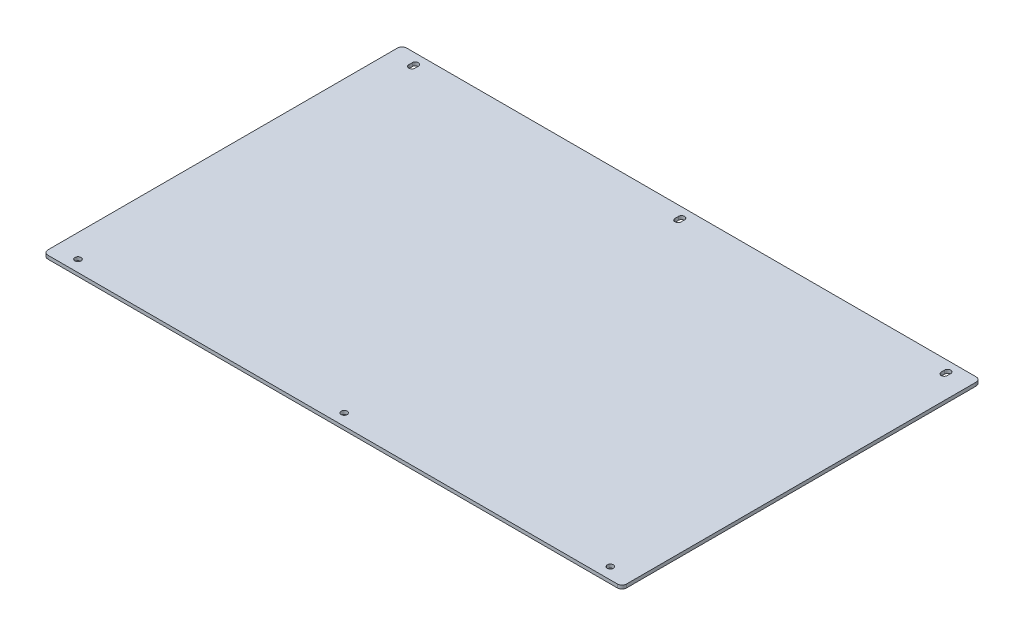
ISO-10303-21;
HEADER;
FILE_DESCRIPTION(('STEP AP214'),'2;1');
FILE_NAME('part.step','',(''),(''),'','','');
FILE_SCHEMA(('AUTOMOTIVE_DESIGN { 1 0 10303 214 1 1 1 1 }'));
ENDSEC;
DATA;
#1=APPLICATION_CONTEXT('core data for automotive mechanical design processes');
#2=APPLICATION_PROTOCOL_DEFINITION('international standard','automotive_design',2000,#1);
#3=PRODUCT_CONTEXT('',#1,'mechanical');
#4=PRODUCT('Part','Part','',(#3));
#5=PRODUCT_RELATED_PRODUCT_CATEGORY('part','',(#4));
#6=PRODUCT_DEFINITION_FORMATION('','',#4);
#7=PRODUCT_DEFINITION_CONTEXT('part definition',#1,'design');
#8=PRODUCT_DEFINITION('design','',#6,#7);
#9=PRODUCT_DEFINITION_SHAPE('','',#8);
#10=(LENGTH_UNIT() NAMED_UNIT(*) SI_UNIT(.MILLI.,.METRE.));
#11=(NAMED_UNIT(*) PLANE_ANGLE_UNIT() SI_UNIT($,.RADIAN.));
#12=(NAMED_UNIT(*) SI_UNIT($,.STERADIAN.) SOLID_ANGLE_UNIT());
#13=UNCERTAINTY_MEASURE_WITH_UNIT(LENGTH_MEASURE(1.E-05),#10,'distance_accuracy_value','');
#14=(GEOMETRIC_REPRESENTATION_CONTEXT(3) GLOBAL_UNCERTAINTY_ASSIGNED_CONTEXT((#13)) GLOBAL_UNIT_ASSIGNED_CONTEXT((#10,
#11,#12)) REPRESENTATION_CONTEXT('',''));
#15=CARTESIAN_POINT('',(0.,0.,0.));
#16=DIRECTION('',(0.,0.,1.));
#17=DIRECTION('',(1.,0.,0.));
#18=AXIS2_PLACEMENT_3D('',#15,#16,#17);
#19=CARTESIAN_POINT('',(250.,3.,155.));
#20=DIRECTION('',(-1.,0.,0.));
#21=DIRECTION('',(0.,0.,1.));
#22=AXIS2_PLACEMENT_3D('',#19,#20,#21);
#23=PLANE('',#22);
#24=DIRECTION('',(0.,0.,-1.));
#25=VECTOR('',#24,1.);
#26=CARTESIAN_POINT('',(250.,0.,155.));
#27=LINE('',#26,#25);
#28=CARTESIAN_POINT('',(250.,0.,151.));
#29=VERTEX_POINT('',#28);
#30=CARTESIAN_POINT('',(250.,0.,-151.));
#31=VERTEX_POINT('',#30);
#32=EDGE_CURVE('E292',#29,#31,#27,.T.);
#33=ORIENTED_EDGE('',*,*,#32,.T.);
#34=DIRECTION('',(0.,-1.,0.));
#35=VECTOR('',#34,1.);
#36=CARTESIAN_POINT('',(250.,3.,-151.));
#37=LINE('',#36,#35);
#38=CARTESIAN_POINT('',(250.,3.,-151.));
#39=VERTEX_POINT('',#38);
#40=EDGE_CURVE('E11',#31,#39,#37,.F.);
#41=ORIENTED_EDGE('',*,*,#40,.T.);
#42=DIRECTION('',(0.,0.,-1.));
#43=VECTOR('',#42,1.);
#44=CARTESIAN_POINT('',(250.,3.,155.));
#45=LINE('',#44,#43);
#46=CARTESIAN_POINT('',(250.,3.,151.));
#47=VERTEX_POINT('',#46);
#48=EDGE_CURVE('E293',#47,#39,#45,.T.);
#49=ORIENTED_EDGE('',*,*,#48,.F.);
#50=DIRECTION('',(0.,-1.,0.));
#51=VECTOR('',#50,1.);
#52=CARTESIAN_POINT('',(250.,3.,151.));
#53=LINE('',#52,#51);
#54=EDGE_CURVE('E41',#47,#29,#53,.T.);
#55=ORIENTED_EDGE('',*,*,#54,.T.);
#56=EDGE_LOOP('',(#33,#41,#49,#55));
#57=FACE_BOUND('',#56,.T.);
#58=ADVANCED_FACE('F33',(#57),#23,.F.);
#59=CARTESIAN_POINT('',(-250.,3.,-155.));
#60=DIRECTION('',(0.,0.,1.));
#61=DIRECTION('',(1.,0.,0.));
#62=AXIS2_PLACEMENT_3D('',#59,#60,#61);
#63=PLANE('',#62);
#64=DIRECTION('',(-1.,0.,0.));
#65=VECTOR('',#64,1.);
#66=CARTESIAN_POINT('',(-250.,0.,-155.));
#67=LINE('',#66,#65);
#68=CARTESIAN_POINT('',(246.,0.,-155.));
#69=VERTEX_POINT('',#68);
#70=CARTESIAN_POINT('',(-246.,0.,-155.));
#71=VERTEX_POINT('',#70);
#72=EDGE_CURVE('E309',#69,#71,#67,.T.);
#73=ORIENTED_EDGE('',*,*,#72,.T.);
#74=DIRECTION('',(0.,-1.,0.));
#75=VECTOR('',#74,1.);
#76=CARTESIAN_POINT('',(-246.,3.,-155.));
#77=LINE('',#76,#75);
#78=CARTESIAN_POINT('',(-246.,3.,-155.));
#79=VERTEX_POINT('',#78);
#80=EDGE_CURVE('E345',#71,#79,#77,.F.);
#81=ORIENTED_EDGE('',*,*,#80,.T.);
#82=DIRECTION('',(-1.,0.,0.));
#83=VECTOR('',#82,1.);
#84=CARTESIAN_POINT('',(-250.,3.,-155.));
#85=LINE('',#84,#83);
#86=CARTESIAN_POINT('',(246.,3.,-155.));
#87=VERTEX_POINT('',#86);
#88=EDGE_CURVE('E296',#87,#79,#85,.T.);
#89=ORIENTED_EDGE('',*,*,#88,.F.);
#90=DIRECTION('',(0.,-1.,0.));
#91=VECTOR('',#90,1.);
#92=CARTESIAN_POINT('',(246.,3.,-155.));
#93=LINE('',#92,#91);
#94=EDGE_CURVE('E342',#87,#69,#93,.T.);
#95=ORIENTED_EDGE('',*,*,#94,.T.);
#96=EDGE_LOOP('',(#73,#81,#89,#95));
#97=FACE_BOUND('',#96,.T.);
#98=ADVANCED_FACE('F363',(#97),#63,.F.);
#99=CARTESIAN_POINT('',(-250.,3.,155.));
#100=DIRECTION('',(1.,0.,0.));
#101=DIRECTION('',(0.,0.,-1.));
#102=AXIS2_PLACEMENT_3D('',#99,#100,#101);
#103=PLANE('',#102);
#104=DIRECTION('',(0.,0.,1.));
#105=VECTOR('',#104,1.);
#106=CARTESIAN_POINT('',(-250.,0.,155.));
#107=LINE('',#106,#105);
#108=CARTESIAN_POINT('',(-250.,0.,-151.));
#109=VERTEX_POINT('',#108);
#110=CARTESIAN_POINT('',(-250.,0.,151.));
#111=VERTEX_POINT('',#110);
#112=EDGE_CURVE('E312',#109,#111,#107,.T.);
#113=ORIENTED_EDGE('',*,*,#112,.T.);
#114=DIRECTION('',(0.,-1.,0.));
#115=VECTOR('',#114,1.);
#116=CARTESIAN_POINT('',(-250.,3.,151.));
#117=LINE('',#116,#115);
#118=CARTESIAN_POINT('',(-250.,3.,151.));
#119=VERTEX_POINT('',#118);
#120=EDGE_CURVE('E332',#111,#119,#117,.F.);
#121=ORIENTED_EDGE('',*,*,#120,.T.);
#122=DIRECTION('',(0.,0.,1.));
#123=VECTOR('',#122,1.);
#124=CARTESIAN_POINT('',(-250.,3.,155.));
#125=LINE('',#124,#123);
#126=CARTESIAN_POINT('',(-250.,3.,-151.));
#127=VERTEX_POINT('',#126);
#128=EDGE_CURVE('E300',#127,#119,#125,.T.);
#129=ORIENTED_EDGE('',*,*,#128,.F.);
#130=DIRECTION('',(0.,-1.,0.));
#131=VECTOR('',#130,1.);
#132=CARTESIAN_POINT('',(-250.,3.,-151.));
#133=LINE('',#132,#131);
#134=EDGE_CURVE('E329',#127,#109,#133,.T.);
#135=ORIENTED_EDGE('',*,*,#134,.T.);
#136=EDGE_LOOP('',(#113,#121,#129,#135));
#137=FACE_BOUND('',#136,.T.);
#138=ADVANCED_FACE('F374',(#137),#103,.F.);
#139=CARTESIAN_POINT('',(-250.,3.,155.));
#140=DIRECTION('',(0.,0.,-1.));
#141=DIRECTION('',(-1.,0.,0.));
#142=AXIS2_PLACEMENT_3D('',#139,#140,#141);
#143=PLANE('',#142);
#144=DIRECTION('',(1.,0.,0.));
#145=VECTOR('',#144,1.);
#146=CARTESIAN_POINT('',(-250.,3.,155.));
#147=LINE('',#146,#145);
#148=CARTESIAN_POINT('',(-246.,3.,155.));
#149=VERTEX_POINT('',#148);
#150=CARTESIAN_POINT('',(246.,3.,155.));
#151=VERTEX_POINT('',#150);
#152=EDGE_CURVE('E303',#149,#151,#147,.T.);
#153=ORIENTED_EDGE('',*,*,#152,.F.);
#154=DIRECTION('',(0.,-1.,0.));
#155=VECTOR('',#154,1.);
#156=CARTESIAN_POINT('',(-246.,3.,155.));
#157=LINE('',#156,#155);
#158=CARTESIAN_POINT('',(-246.,0.,155.));
#159=VERTEX_POINT('',#158);
#160=EDGE_CURVE('E318',#149,#159,#157,.T.);
#161=ORIENTED_EDGE('',*,*,#160,.T.);
#162=DIRECTION('',(1.,0.,0.));
#163=VECTOR('',#162,1.);
#164=CARTESIAN_POINT('',(-250.,0.,155.));
#165=LINE('',#164,#163);
#166=CARTESIAN_POINT('',(246.,0.,155.));
#167=VERTEX_POINT('',#166);
#168=EDGE_CURVE('E297',#159,#167,#165,.T.);
#169=ORIENTED_EDGE('',*,*,#168,.T.);
#170=DIRECTION('',(0.,-1.,0.));
#171=VECTOR('',#170,1.);
#172=CARTESIAN_POINT('',(246.,3.,155.));
#173=LINE('',#172,#171);
#174=EDGE_CURVE('E306',#167,#151,#173,.F.);
#175=ORIENTED_EDGE('',*,*,#174,.T.);
#176=EDGE_LOOP('',(#153,#161,#169,#175));
#177=FACE_BOUND('',#176,.T.);
#178=ADVANCED_FACE('F382',(#177),#143,.F.);
#179=CARTESIAN_POINT('',(0.,3.,0.));
#180=DIRECTION('',(0.,-1.,0.));
#181=DIRECTION('',(0.,0.,-1.));
#182=AXIS2_PLACEMENT_3D('',#179,#180,#181);
#183=PLANE('',#182);
#184=DIRECTION('',(0.,0.,-1.));
#185=VECTOR('',#184,1.);
#186=CARTESIAN_POINT('',(232.65,3.,-143.5));
#187=LINE('',#186,#185);
#188=CARTESIAN_POINT('',(232.65,3.,-143.5));
#189=VERTEX_POINT('',#188);
#190=CARTESIAN_POINT('',(232.65,3.,-146.5));
#191=VERTEX_POINT('',#190);
#192=EDGE_CURVE('E260',#189,#191,#187,.T.);
#193=ORIENTED_EDGE('',*,*,#192,.F.);
#194=CARTESIAN_POINT('',(230.,3.,-143.5));
#195=DIRECTION('',(0.,1.,0.));
#196=DIRECTION('',(0.,0.,1.));
#197=AXIS2_PLACEMENT_3D('',#194,#195,#196);
#198=CIRCLE('',#197,2.64999999999999);
#199=CARTESIAN_POINT('',(227.35,3.,-143.5));
#200=VERTEX_POINT('',#199);
#201=EDGE_CURVE('E257',#200,#189,#198,.T.);
#202=ORIENTED_EDGE('',*,*,#201,.F.);
#203=DIRECTION('',(0.,0.,1.));
#204=VECTOR('',#203,1.);
#205=CARTESIAN_POINT('',(227.35,3.,-143.5));
#206=LINE('',#205,#204);
#207=CARTESIAN_POINT('',(227.35,3.,-146.5));
#208=VERTEX_POINT('',#207);
#209=EDGE_CURVE('E247',#208,#200,#206,.T.);
#210=ORIENTED_EDGE('',*,*,#209,.F.);
#211=CARTESIAN_POINT('',(230.,3.,-146.5));
#212=DIRECTION('',(0.,1.,0.));
#213=DIRECTION('',(0.,0.,1.));
#214=AXIS2_PLACEMENT_3D('',#211,#212,#213);
#215=CIRCLE('',#214,2.64999999999999);
#216=EDGE_CURVE('E262',#191,#208,#215,.T.);
#217=ORIENTED_EDGE('',*,*,#216,.F.);
#218=EDGE_LOOP('',(#193,#202,#210,#217));
#219=FACE_BOUND('',#218,.T.);
#220=CARTESIAN_POINT('',(-230.,3.,145.));
#221=DIRECTION('',(0.,1.,0.));
#222=DIRECTION('',(0.,0.,1.));
#223=AXIS2_PLACEMENT_3D('',#220,#221,#222);
#224=CIRCLE('',#223,2.64999999999999);
#225=CARTESIAN_POINT('',(-230.,3.,147.65));
#226=VERTEX_POINT('',#225);
#227=EDGE_CURVE('E208',#226,#226,#224,.T.);
#228=ORIENTED_EDGE('',*,*,#227,.F.);
#229=EDGE_LOOP('',(#228));
#230=FACE_BOUND('',#229,.T.);
#231=DIRECTION('',(0.,0.,-1.));
#232=VECTOR('',#231,1.);
#233=CARTESIAN_POINT('',(-227.35,3.,-143.5));
#234=LINE('',#233,#232);
#235=CARTESIAN_POINT('',(-227.35,3.,-143.5));
#236=VERTEX_POINT('',#235);
#237=CARTESIAN_POINT('',(-227.35,3.,-146.5));
#238=VERTEX_POINT('',#237);
#239=EDGE_CURVE('E48',#236,#238,#234,.T.);
#240=ORIENTED_EDGE('',*,*,#239,.F.);
#241=CARTESIAN_POINT('',(-230.,3.,-143.5));
#242=DIRECTION('',(0.,1.,0.));
#243=DIRECTION('',(0.,0.,1.));
#244=AXIS2_PLACEMENT_3D('',#241,#242,#243);
#245=CIRCLE('',#244,2.64999999999999);
#246=CARTESIAN_POINT('',(-232.65,3.,-143.5));
#247=VERTEX_POINT('',#246);
#248=EDGE_CURVE('E189',#247,#236,#245,.T.);
#249=ORIENTED_EDGE('',*,*,#248,.F.);
#250=DIRECTION('',(0.,0.,1.));
#251=VECTOR('',#250,1.);
#252=CARTESIAN_POINT('',(-232.65,3.,-143.5));
#253=LINE('',#252,#251);
#254=CARTESIAN_POINT('',(-232.65,3.,-146.5));
#255=VERTEX_POINT('',#254);
#256=EDGE_CURVE('E194',#255,#247,#253,.T.);
#257=ORIENTED_EDGE('',*,*,#256,.F.);
#258=CARTESIAN_POINT('',(-230.,3.,-146.5));
#259=DIRECTION('',(0.,1.,0.));
#260=DIRECTION('',(0.,0.,1.));
#261=AXIS2_PLACEMENT_3D('',#258,#259,#260);
#262=CIRCLE('',#261,2.64999999999999);
#263=EDGE_CURVE('E196',#238,#255,#262,.T.);
#264=ORIENTED_EDGE('',*,*,#263,.F.);
#265=EDGE_LOOP('',(#240,#249,#257,#264));
#266=FACE_BOUND('',#265,.T.);
#267=CARTESIAN_POINT('',(230.,3.,145.));
#268=DIRECTION('',(0.,1.,0.));
#269=DIRECTION('',(0.,0.,1.));
#270=AXIS2_PLACEMENT_3D('',#267,#268,#269);
#271=CIRCLE('',#270,2.64999999999999);
#272=CARTESIAN_POINT('',(230.,3.,147.65));
#273=VERTEX_POINT('',#272);
#274=EDGE_CURVE('E280',#273,#273,#271,.T.);
#275=ORIENTED_EDGE('',*,*,#274,.F.);
#276=EDGE_LOOP('',(#275));
#277=FACE_BOUND('',#276,.T.);
#278=DIRECTION('',(0.,0.,-1.));
#279=VECTOR('',#278,1.);
#280=CARTESIAN_POINT('',(2.65000000000007,3.,-143.5));
#281=LINE('',#280,#279);
#282=CARTESIAN_POINT('',(2.65000000000007,3.,-143.5));
#283=VERTEX_POINT('',#282);
#284=CARTESIAN_POINT('',(2.65000000000007,3.,-146.5));
#285=VERTEX_POINT('',#284);
#286=EDGE_CURVE('E56',#283,#285,#281,.T.);
#287=ORIENTED_EDGE('',*,*,#286,.F.);
#288=CARTESIAN_POINT('',(0.,3.,-143.5));
#289=DIRECTION('',(0.,1.,0.));
#290=DIRECTION('',(0.,0.,1.));
#291=AXIS2_PLACEMENT_3D('',#288,#289,#290);
#292=CIRCLE('',#291,2.64999999999999);
#293=CARTESIAN_POINT('',(-2.6499999999999,3.,-143.5));
#294=VERTEX_POINT('',#293);
#295=EDGE_CURVE('E226',#294,#283,#292,.T.);
#296=ORIENTED_EDGE('',*,*,#295,.F.);
#297=DIRECTION('',(0.,0.,1.));
#298=VECTOR('',#297,1.);
#299=CARTESIAN_POINT('',(-2.6499999999999,3.,-143.5));
#300=LINE('',#299,#298);
#301=CARTESIAN_POINT('',(-2.6499999999999,3.,-146.5));
#302=VERTEX_POINT('',#301);
#303=EDGE_CURVE('E216',#302,#294,#300,.T.);
#304=ORIENTED_EDGE('',*,*,#303,.F.);
#305=CARTESIAN_POINT('',(0.,3.,-146.5));
#306=DIRECTION('',(0.,1.,0.));
#307=DIRECTION('',(0.,0.,1.));
#308=AXIS2_PLACEMENT_3D('',#305,#306,#307);
#309=CIRCLE('',#308,2.64999999999999);
#310=EDGE_CURVE('E230',#285,#302,#309,.T.);
#311=ORIENTED_EDGE('',*,*,#310,.F.);
#312=EDGE_LOOP('',(#287,#296,#304,#311));
#313=FACE_BOUND('',#312,.T.);
#314=CARTESIAN_POINT('',(0.,3.,145.));
#315=DIRECTION('',(0.,1.,0.));
#316=DIRECTION('',(0.,0.,1.));
#317=AXIS2_PLACEMENT_3D('',#314,#315,#316);
#318=CIRCLE('',#317,2.65);
#319=CARTESIAN_POINT('',(0.,3.,147.65));
#320=VERTEX_POINT('',#319);
#321=EDGE_CURVE('E286',#320,#320,#318,.T.);
#322=ORIENTED_EDGE('',*,*,#321,.F.);
#323=EDGE_LOOP('',(#322));
#324=FACE_BOUND('',#323,.T.);
#325=ORIENTED_EDGE('',*,*,#128,.T.);
#326=CARTESIAN_POINT('',(-246.,3.,151.));
#327=DIRECTION('',(0.,-1.,0.));
#328=DIRECTION('',(0.,0.,-1.));
#329=AXIS2_PLACEMENT_3D('',#326,#327,#328);
#330=CIRCLE('',#329,4.);
#331=EDGE_CURVE('E340',#119,#149,#330,.F.);
#332=ORIENTED_EDGE('',*,*,#331,.T.);
#333=ORIENTED_EDGE('',*,*,#152,.T.);
#334=CARTESIAN_POINT('',(246.,3.,151.));
#335=DIRECTION('',(0.,-1.,0.));
#336=DIRECTION('',(0.,0.,-1.));
#337=AXIS2_PLACEMENT_3D('',#334,#335,#336);
#338=CIRCLE('',#337,4.);
#339=EDGE_CURVE('E334',#151,#47,#338,.F.);
#340=ORIENTED_EDGE('',*,*,#339,.T.);
#341=ORIENTED_EDGE('',*,*,#48,.T.);
#342=CARTESIAN_POINT('',(246.,3.,-151.));
#343=DIRECTION('',(0.,-1.,0.));
#344=DIRECTION('',(0.,0.,-1.));
#345=AXIS2_PLACEMENT_3D('',#342,#343,#344);
#346=CIRCLE('',#345,4.);
#347=EDGE_CURVE('E336',#39,#87,#346,.F.);
#348=ORIENTED_EDGE('',*,*,#347,.T.);
#349=ORIENTED_EDGE('',*,*,#88,.T.);
#350=CARTESIAN_POINT('',(-246.,3.,-151.));
#351=DIRECTION('',(0.,-1.,0.));
#352=DIRECTION('',(0.,0.,-1.));
#353=AXIS2_PLACEMENT_3D('',#350,#351,#352);
#354=CIRCLE('',#353,4.);
#355=EDGE_CURVE('E338',#79,#127,#354,.F.);
#356=ORIENTED_EDGE('',*,*,#355,.T.);
#357=EDGE_LOOP('',(#325,#332,#333,#340,#341,#348,#349,#356));
#358=FACE_BOUND('',#357,.T.);
#359=ADVANCED_FACE('F367',(#219,#230,#266,#277,#313,#324,#358),#183,.F.);
#360=CARTESIAN_POINT('',(0.,0.,0.));
#361=DIRECTION('',(0.,-1.,0.));
#362=DIRECTION('',(0.,0.,-1.));
#363=AXIS2_PLACEMENT_3D('',#360,#361,#362);
#364=PLANE('',#363);
#365=CARTESIAN_POINT('',(-230.,0.,-143.5));
#366=DIRECTION('',(0.,1.,0.));
#367=DIRECTION('',(0.,0.,1.));
#368=AXIS2_PLACEMENT_3D('',#365,#366,#367);
#369=CIRCLE('',#368,2.64999999999999);
#370=CARTESIAN_POINT('',(-232.65,0.,-143.5));
#371=VERTEX_POINT('',#370);
#372=CARTESIAN_POINT('',(-227.35,0.,-143.5));
#373=VERTEX_POINT('',#372);
#374=EDGE_CURVE('E182',#371,#373,#369,.T.);
#375=ORIENTED_EDGE('',*,*,#374,.T.);
#376=DIRECTION('',(0.,0.,-1.));
#377=VECTOR('',#376,1.);
#378=CARTESIAN_POINT('',(-227.35,0.,-143.5));
#379=LINE('',#378,#377);
#380=CARTESIAN_POINT('',(-227.35,0.,-146.5));
#381=VERTEX_POINT('',#380);
#382=EDGE_CURVE('E171',#373,#381,#379,.T.);
#383=ORIENTED_EDGE('',*,*,#382,.T.);
#384=CARTESIAN_POINT('',(-230.,0.,-146.5));
#385=DIRECTION('',(0.,1.,0.));
#386=DIRECTION('',(0.,0.,1.));
#387=AXIS2_PLACEMENT_3D('',#384,#385,#386);
#388=CIRCLE('',#387,2.64999999999999);
#389=CARTESIAN_POINT('',(-232.65,0.,-146.5));
#390=VERTEX_POINT('',#389);
#391=EDGE_CURVE('E181',#381,#390,#388,.T.);
#392=ORIENTED_EDGE('',*,*,#391,.T.);
#393=DIRECTION('',(0.,0.,1.));
#394=VECTOR('',#393,1.);
#395=CARTESIAN_POINT('',(-232.65,0.,-143.5));
#396=LINE('',#395,#394);
#397=EDGE_CURVE('E190',#390,#371,#396,.T.);
#398=ORIENTED_EDGE('',*,*,#397,.T.);
#399=EDGE_LOOP('',(#375,#383,#392,#398));
#400=FACE_BOUND('',#399,.T.);
#401=CARTESIAN_POINT('',(0.,0.,-143.5));
#402=DIRECTION('',(0.,1.,0.));
#403=DIRECTION('',(0.,0.,1.));
#404=AXIS2_PLACEMENT_3D('',#401,#402,#403);
#405=CIRCLE('',#404,2.64999999999999);
#406=CARTESIAN_POINT('',(-2.6499999999999,0.,-143.5));
#407=VERTEX_POINT('',#406);
#408=CARTESIAN_POINT('',(2.65000000000007,0.,-143.5));
#409=VERTEX_POINT('',#408);
#410=EDGE_CURVE('E212',#407,#409,#405,.T.);
#411=ORIENTED_EDGE('',*,*,#410,.T.);
#412=DIRECTION('',(0.,0.,-1.));
#413=VECTOR('',#412,1.);
#414=CARTESIAN_POINT('',(2.65000000000007,0.,-143.5));
#415=LINE('',#414,#413);
#416=CARTESIAN_POINT('',(2.65000000000007,0.,-146.5));
#417=VERTEX_POINT('',#416);
#418=EDGE_CURVE('E215',#409,#417,#415,.T.);
#419=ORIENTED_EDGE('',*,*,#418,.T.);
#420=CARTESIAN_POINT('',(0.,0.,-146.5));
#421=DIRECTION('',(0.,1.,0.));
#422=DIRECTION('',(0.,0.,1.));
#423=AXIS2_PLACEMENT_3D('',#420,#421,#422);
#424=CIRCLE('',#423,2.64999999999999);
#425=CARTESIAN_POINT('',(-2.6499999999999,0.,-146.5));
#426=VERTEX_POINT('',#425);
#427=EDGE_CURVE('E219',#417,#426,#424,.T.);
#428=ORIENTED_EDGE('',*,*,#427,.T.);
#429=DIRECTION('',(0.,0.,1.));
#430=VECTOR('',#429,1.);
#431=CARTESIAN_POINT('',(-2.6499999999999,0.,-143.5));
#432=LINE('',#431,#430);
#433=EDGE_CURVE('E222',#426,#407,#432,.T.);
#434=ORIENTED_EDGE('',*,*,#433,.T.);
#435=EDGE_LOOP('',(#411,#419,#428,#434));
#436=FACE_BOUND('',#435,.T.);
#437=CARTESIAN_POINT('',(230.,0.,-143.5));
#438=DIRECTION('',(0.,1.,0.));
#439=DIRECTION('',(0.,0.,1.));
#440=AXIS2_PLACEMENT_3D('',#437,#438,#439);
#441=CIRCLE('',#440,2.64999999999999);
#442=CARTESIAN_POINT('',(227.35,0.,-143.5));
#443=VERTEX_POINT('',#442);
#444=CARTESIAN_POINT('',(232.65,0.,-143.5));
#445=VERTEX_POINT('',#444);
#446=EDGE_CURVE('E243',#443,#445,#441,.T.);
#447=ORIENTED_EDGE('',*,*,#446,.T.);
#448=DIRECTION('',(0.,0.,-1.));
#449=VECTOR('',#448,1.);
#450=CARTESIAN_POINT('',(232.65,0.,-143.5));
#451=LINE('',#450,#449);
#452=CARTESIAN_POINT('',(232.65,0.,-146.5));
#453=VERTEX_POINT('',#452);
#454=EDGE_CURVE('E246',#445,#453,#451,.T.);
#455=ORIENTED_EDGE('',*,*,#454,.T.);
#456=CARTESIAN_POINT('',(230.,0.,-146.5));
#457=DIRECTION('',(0.,1.,0.));
#458=DIRECTION('',(0.,0.,1.));
#459=AXIS2_PLACEMENT_3D('',#456,#457,#458);
#460=CIRCLE('',#459,2.64999999999999);
#461=CARTESIAN_POINT('',(227.35,0.,-146.5));
#462=VERTEX_POINT('',#461);
#463=EDGE_CURVE('E250',#453,#462,#460,.T.);
#464=ORIENTED_EDGE('',*,*,#463,.T.);
#465=DIRECTION('',(0.,0.,1.));
#466=VECTOR('',#465,1.);
#467=CARTESIAN_POINT('',(227.35,0.,-143.5));
#468=LINE('',#467,#466);
#469=EDGE_CURVE('E253',#462,#443,#468,.T.);
#470=ORIENTED_EDGE('',*,*,#469,.T.);
#471=EDGE_LOOP('',(#447,#455,#464,#470));
#472=FACE_BOUND('',#471,.T.);
#473=CARTESIAN_POINT('',(-230.,0.,145.));
#474=DIRECTION('',(0.,1.,0.));
#475=DIRECTION('',(0.,0.,1.));
#476=AXIS2_PLACEMENT_3D('',#473,#474,#475);
#477=CIRCLE('',#476,2.64999999999999);
#478=CARTESIAN_POINT('',(-230.,0.,147.65));
#479=VERTEX_POINT('',#478);
#480=EDGE_CURVE('E277',#479,#479,#477,.T.);
#481=ORIENTED_EDGE('',*,*,#480,.T.);
#482=EDGE_LOOP('',(#481));
#483=FACE_BOUND('',#482,.T.);
#484=CARTESIAN_POINT('',(230.,0.,145.));
#485=DIRECTION('',(0.,1.,0.));
#486=DIRECTION('',(0.,0.,1.));
#487=AXIS2_PLACEMENT_3D('',#484,#485,#486);
#488=CIRCLE('',#487,2.64999999999999);
#489=CARTESIAN_POINT('',(230.,0.,147.65));
#490=VERTEX_POINT('',#489);
#491=EDGE_CURVE('E283',#490,#490,#488,.T.);
#492=ORIENTED_EDGE('',*,*,#491,.T.);
#493=EDGE_LOOP('',(#492));
#494=FACE_BOUND('',#493,.T.);
#495=CARTESIAN_POINT('',(0.,0.,145.));
#496=DIRECTION('',(0.,1.,0.));
#497=DIRECTION('',(0.,0.,1.));
#498=AXIS2_PLACEMENT_3D('',#495,#496,#497);
#499=CIRCLE('',#498,2.65);
#500=CARTESIAN_POINT('',(0.,0.,147.65));
#501=VERTEX_POINT('',#500);
#502=EDGE_CURVE('E289',#501,#501,#499,.T.);
#503=ORIENTED_EDGE('',*,*,#502,.T.);
#504=EDGE_LOOP('',(#503));
#505=FACE_BOUND('',#504,.T.);
#506=ORIENTED_EDGE('',*,*,#168,.F.);
#507=CARTESIAN_POINT('',(-246.,0.,151.));
#508=DIRECTION('',(0.,-1.,0.));
#509=DIRECTION('',(0.,0.,-1.));
#510=AXIS2_PLACEMENT_3D('',#507,#508,#509);
#511=CIRCLE('',#510,4.);
#512=EDGE_CURVE('E327',#159,#111,#511,.T.);
#513=ORIENTED_EDGE('',*,*,#512,.T.);
#514=ORIENTED_EDGE('',*,*,#112,.F.);
#515=CARTESIAN_POINT('',(-246.,0.,-151.));
#516=DIRECTION('',(0.,-1.,0.));
#517=DIRECTION('',(0.,0.,-1.));
#518=AXIS2_PLACEMENT_3D('',#515,#516,#517);
#519=CIRCLE('',#518,4.);
#520=EDGE_CURVE('E325',#109,#71,#519,.T.);
#521=ORIENTED_EDGE('',*,*,#520,.T.);
#522=ORIENTED_EDGE('',*,*,#72,.F.);
#523=CARTESIAN_POINT('',(246.,0.,-151.));
#524=DIRECTION('',(0.,-1.,0.));
#525=DIRECTION('',(0.,0.,-1.));
#526=AXIS2_PLACEMENT_3D('',#523,#524,#525);
#527=CIRCLE('',#526,4.);
#528=EDGE_CURVE('E323',#69,#31,#527,.T.);
#529=ORIENTED_EDGE('',*,*,#528,.T.);
#530=ORIENTED_EDGE('',*,*,#32,.F.);
#531=CARTESIAN_POINT('',(246.,0.,151.));
#532=DIRECTION('',(0.,-1.,0.));
#533=DIRECTION('',(0.,0.,-1.));
#534=AXIS2_PLACEMENT_3D('',#531,#532,#533);
#535=CIRCLE('',#534,4.);
#536=EDGE_CURVE('E321',#29,#167,#535,.T.);
#537=ORIENTED_EDGE('',*,*,#536,.T.);
#538=EDGE_LOOP('',(#506,#513,#514,#521,#522,#529,#530,#537));
#539=FACE_BOUND('',#538,.T.);
#540=ADVANCED_FACE('F192',(#400,#436,#472,#483,#494,#505,#539),#364,.T.);
#541=CARTESIAN_POINT('',(-246.,3.,151.));
#542=DIRECTION('',(0.,-1.,0.));
#543=DIRECTION('',(0.,0.,-1.));
#544=AXIS2_PLACEMENT_3D('',#541,#542,#543);
#545=CYLINDRICAL_SURFACE('',#544,4.);
#546=ORIENTED_EDGE('',*,*,#331,.F.);
#547=ORIENTED_EDGE('',*,*,#120,.F.);
#548=ORIENTED_EDGE('',*,*,#512,.F.);
#549=ORIENTED_EDGE('',*,*,#160,.F.);
#550=EDGE_LOOP('',(#546,#547,#548,#549));
#551=FACE_BOUND('',#550,.T.);
#552=ADVANCED_FACE('F379',(#551),#545,.T.);
#553=CARTESIAN_POINT('',(-246.,3.,-151.));
#554=DIRECTION('',(0.,-1.,0.));
#555=DIRECTION('',(0.,0.,-1.));
#556=AXIS2_PLACEMENT_3D('',#553,#554,#555);
#557=CYLINDRICAL_SURFACE('',#556,4.);
#558=ORIENTED_EDGE('',*,*,#355,.F.);
#559=ORIENTED_EDGE('',*,*,#80,.F.);
#560=ORIENTED_EDGE('',*,*,#520,.F.);
#561=ORIENTED_EDGE('',*,*,#134,.F.);
#562=EDGE_LOOP('',(#558,#559,#560,#561));
#563=FACE_BOUND('',#562,.T.);
#564=ADVANCED_FACE('F371',(#563),#557,.T.);
#565=CARTESIAN_POINT('',(246.,3.,-151.));
#566=DIRECTION('',(0.,-1.,0.));
#567=DIRECTION('',(0.,0.,-1.));
#568=AXIS2_PLACEMENT_3D('',#565,#566,#567);
#569=CYLINDRICAL_SURFACE('',#568,4.);
#570=ORIENTED_EDGE('',*,*,#347,.F.);
#571=ORIENTED_EDGE('',*,*,#40,.F.);
#572=ORIENTED_EDGE('',*,*,#528,.F.);
#573=ORIENTED_EDGE('',*,*,#94,.F.);
#574=EDGE_LOOP('',(#570,#571,#572,#573));
#575=FACE_BOUND('',#574,.T.);
#576=ADVANCED_FACE('F360',(#575),#569,.T.);
#577=CARTESIAN_POINT('',(246.,3.,151.));
#578=DIRECTION('',(0.,-1.,0.));
#579=DIRECTION('',(0.,0.,-1.));
#580=AXIS2_PLACEMENT_3D('',#577,#578,#579);
#581=CYLINDRICAL_SURFACE('',#580,4.);
#582=ORIENTED_EDGE('',*,*,#339,.F.);
#583=ORIENTED_EDGE('',*,*,#174,.F.);
#584=ORIENTED_EDGE('',*,*,#536,.F.);
#585=ORIENTED_EDGE('',*,*,#54,.F.);
#586=EDGE_LOOP('',(#582,#583,#584,#585));
#587=FACE_BOUND('',#586,.T.);
#588=ADVANCED_FACE('F35',(#587),#581,.T.);
#589=CARTESIAN_POINT('',(0.,3.,145.));
#590=DIRECTION('',(0.,1.,0.));
#591=DIRECTION('',(0.,0.,1.));
#592=AXIS2_PLACEMENT_3D('',#589,#590,#591);
#593=CYLINDRICAL_SURFACE('',#592,2.65);
#594=ORIENTED_EDGE('',*,*,#502,.F.);
#595=EDGE_LOOP('',(#594));
#596=FACE_BOUND('',#595,.T.);
#597=ORIENTED_EDGE('',*,*,#321,.T.);
#598=EDGE_LOOP('',(#597));
#599=FACE_BOUND('',#598,.T.);
#600=ADVANCED_FACE('F385',(#596,#599),#593,.F.);
#601=CARTESIAN_POINT('',(230.,3.,145.));
#602=DIRECTION('',(0.,1.,0.));
#603=DIRECTION('',(0.,0.,1.));
#604=AXIS2_PLACEMENT_3D('',#601,#602,#603);
#605=CYLINDRICAL_SURFACE('',#604,2.64999999999999);
#606=ORIENTED_EDGE('',*,*,#491,.F.);
#607=EDGE_LOOP('',(#606));
#608=FACE_BOUND('',#607,.T.);
#609=ORIENTED_EDGE('',*,*,#274,.T.);
#610=EDGE_LOOP('',(#609));
#611=FACE_BOUND('',#610,.T.);
#612=ADVANCED_FACE('F390',(#608,#611),#605,.F.);
#613=CARTESIAN_POINT('',(-230.,3.,145.));
#614=DIRECTION('',(0.,1.,0.));
#615=DIRECTION('',(0.,0.,1.));
#616=AXIS2_PLACEMENT_3D('',#613,#614,#615);
#617=CYLINDRICAL_SURFACE('',#616,2.64999999999999);
#618=ORIENTED_EDGE('',*,*,#480,.F.);
#619=EDGE_LOOP('',(#618));
#620=FACE_BOUND('',#619,.T.);
#621=ORIENTED_EDGE('',*,*,#227,.T.);
#622=EDGE_LOOP('',(#621));
#623=FACE_BOUND('',#622,.T.);
#624=ADVANCED_FACE('F432',(#620,#623),#617,.F.);
#625=CARTESIAN_POINT('',(227.35,0.,-143.5));
#626=DIRECTION('',(-1.,0.,0.));
#627=DIRECTION('',(0.,0.,1.));
#628=AXIS2_PLACEMENT_3D('',#625,#626,#627);
#629=PLANE('',#628);
#630=ORIENTED_EDGE('',*,*,#209,.T.);
#631=DIRECTION('',(0.,1.,0.));
#632=VECTOR('',#631,1.);
#633=CARTESIAN_POINT('',(227.35,0.,-143.5));
#634=LINE('',#633,#632);
#635=EDGE_CURVE('E228',#443,#200,#634,.T.);
#636=ORIENTED_EDGE('',*,*,#635,.F.);
#637=ORIENTED_EDGE('',*,*,#469,.F.);
#638=DIRECTION('',(0.,1.,0.));
#639=VECTOR('',#638,1.);
#640=CARTESIAN_POINT('',(227.35,0.,-146.5));
#641=LINE('',#640,#639);
#642=EDGE_CURVE('E268',#462,#208,#641,.T.);
#643=ORIENTED_EDGE('',*,*,#642,.T.);
#644=EDGE_LOOP('',(#630,#636,#637,#643));
#645=FACE_BOUND('',#644,.T.);
#646=ADVANCED_FACE('F442',(#645),#629,.F.);
#647=CARTESIAN_POINT('',(232.65,0.,-143.5));
#648=DIRECTION('',(1.,0.,0.));
#649=DIRECTION('',(0.,0.,-1.));
#650=AXIS2_PLACEMENT_3D('',#647,#648,#649);
#651=PLANE('',#650);
#652=ORIENTED_EDGE('',*,*,#192,.T.);
#653=DIRECTION('',(0.,1.,0.));
#654=VECTOR('',#653,1.);
#655=CARTESIAN_POINT('',(232.65,0.,-146.5));
#656=LINE('',#655,#654);
#657=EDGE_CURVE('E270',#453,#191,#656,.T.);
#658=ORIENTED_EDGE('',*,*,#657,.F.);
#659=ORIENTED_EDGE('',*,*,#454,.F.);
#660=DIRECTION('',(0.,1.,0.));
#661=VECTOR('',#660,1.);
#662=CARTESIAN_POINT('',(232.65,0.,-143.5));
#663=LINE('',#662,#661);
#664=EDGE_CURVE('E256',#445,#189,#663,.T.);
#665=ORIENTED_EDGE('',*,*,#664,.T.);
#666=EDGE_LOOP('',(#652,#658,#659,#665));
#667=FACE_BOUND('',#666,.T.);
#668=ADVANCED_FACE('F471',(#667),#651,.F.);
#669=CARTESIAN_POINT('',(230.,0.,-143.5));
#670=DIRECTION('',(0.,1.,0.));
#671=DIRECTION('',(0.,0.,1.));
#672=AXIS2_PLACEMENT_3D('',#669,#670,#671);
#673=CYLINDRICAL_SURFACE('',#672,2.64999999999999);
#674=ORIENTED_EDGE('',*,*,#201,.T.);
#675=ORIENTED_EDGE('',*,*,#664,.F.);
#676=ORIENTED_EDGE('',*,*,#446,.F.);
#677=ORIENTED_EDGE('',*,*,#635,.T.);
#678=EDGE_LOOP('',(#674,#675,#676,#677));
#679=FACE_BOUND('',#678,.T.);
#680=ADVANCED_FACE('F481',(#679),#673,.F.);
#681=CARTESIAN_POINT('',(230.,0.,-146.5));
#682=DIRECTION('',(0.,1.,0.));
#683=DIRECTION('',(0.,0.,1.));
#684=AXIS2_PLACEMENT_3D('',#681,#682,#683);
#685=CYLINDRICAL_SURFACE('',#684,2.64999999999999);
#686=ORIENTED_EDGE('',*,*,#216,.T.);
#687=ORIENTED_EDGE('',*,*,#642,.F.);
#688=ORIENTED_EDGE('',*,*,#463,.F.);
#689=ORIENTED_EDGE('',*,*,#657,.T.);
#690=EDGE_LOOP('',(#686,#687,#688,#689));
#691=FACE_BOUND('',#690,.T.);
#692=ADVANCED_FACE('F491',(#691),#685,.F.);
#693=CARTESIAN_POINT('',(-2.6499999999999,0.,-143.5));
#694=DIRECTION('',(-1.,0.,0.));
#695=DIRECTION('',(0.,0.,1.));
#696=AXIS2_PLACEMENT_3D('',#693,#694,#695);
#697=PLANE('',#696);
#698=ORIENTED_EDGE('',*,*,#303,.T.);
#699=DIRECTION('',(0.,1.,0.));
#700=VECTOR('',#699,1.);
#701=CARTESIAN_POINT('',(-2.6499999999999,0.,-143.5));
#702=LINE('',#701,#700);
#703=EDGE_CURVE('E202',#407,#294,#702,.T.);
#704=ORIENTED_EDGE('',*,*,#703,.F.);
#705=ORIENTED_EDGE('',*,*,#433,.F.);
#706=DIRECTION('',(0.,1.,0.));
#707=VECTOR('',#706,1.);
#708=CARTESIAN_POINT('',(-2.6499999999999,0.,-146.5));
#709=LINE('',#708,#707);
#710=EDGE_CURVE('E236',#426,#302,#709,.T.);
#711=ORIENTED_EDGE('',*,*,#710,.T.);
#712=EDGE_LOOP('',(#698,#704,#705,#711));
#713=FACE_BOUND('',#712,.T.);
#714=ADVANCED_FACE('F501',(#713),#697,.F.);
#715=CARTESIAN_POINT('',(2.65000000000007,0.,-143.5));
#716=DIRECTION('',(1.,0.,0.));
#717=DIRECTION('',(0.,0.,-1.));
#718=AXIS2_PLACEMENT_3D('',#715,#716,#717);
#719=PLANE('',#718);
#720=ORIENTED_EDGE('',*,*,#286,.T.);
#721=DIRECTION('',(0.,1.,0.));
#722=VECTOR('',#721,1.);
#723=CARTESIAN_POINT('',(2.65000000000007,0.,-146.5));
#724=LINE('',#723,#722);
#725=EDGE_CURVE('E238',#417,#285,#724,.T.);
#726=ORIENTED_EDGE('',*,*,#725,.F.);
#727=ORIENTED_EDGE('',*,*,#418,.F.);
#728=DIRECTION('',(0.,1.,0.));
#729=VECTOR('',#728,1.);
#730=CARTESIAN_POINT('',(2.65000000000007,0.,-143.5));
#731=LINE('',#730,#729);
#732=EDGE_CURVE('E225',#409,#283,#731,.T.);
#733=ORIENTED_EDGE('',*,*,#732,.T.);
#734=EDGE_LOOP('',(#720,#726,#727,#733));
#735=FACE_BOUND('',#734,.T.);
#736=ADVANCED_FACE('F511',(#735),#719,.F.);
#737=CARTESIAN_POINT('',(0.,0.,-143.5));
#738=DIRECTION('',(0.,1.,0.));
#739=DIRECTION('',(0.,0.,1.));
#740=AXIS2_PLACEMENT_3D('',#737,#738,#739);
#741=CYLINDRICAL_SURFACE('',#740,2.64999999999999);
#742=ORIENTED_EDGE('',*,*,#295,.T.);
#743=ORIENTED_EDGE('',*,*,#732,.F.);
#744=ORIENTED_EDGE('',*,*,#410,.F.);
#745=ORIENTED_EDGE('',*,*,#703,.T.);
#746=EDGE_LOOP('',(#742,#743,#744,#745));
#747=FACE_BOUND('',#746,.T.);
#748=ADVANCED_FACE('F521',(#747),#741,.F.);
#749=CARTESIAN_POINT('',(0.,0.,-146.5));
#750=DIRECTION('',(0.,1.,0.));
#751=DIRECTION('',(0.,0.,1.));
#752=AXIS2_PLACEMENT_3D('',#749,#750,#751);
#753=CYLINDRICAL_SURFACE('',#752,2.64999999999999);
#754=ORIENTED_EDGE('',*,*,#310,.T.);
#755=ORIENTED_EDGE('',*,*,#710,.F.);
#756=ORIENTED_EDGE('',*,*,#427,.F.);
#757=ORIENTED_EDGE('',*,*,#725,.T.);
#758=EDGE_LOOP('',(#754,#755,#756,#757));
#759=FACE_BOUND('',#758,.T.);
#760=ADVANCED_FACE('F531',(#759),#753,.F.);
#761=CARTESIAN_POINT('',(-232.65,0.,-143.5));
#762=DIRECTION('',(-1.,0.,0.));
#763=DIRECTION('',(0.,0.,1.));
#764=AXIS2_PLACEMENT_3D('',#761,#762,#763);
#765=PLANE('',#764);
#766=ORIENTED_EDGE('',*,*,#256,.T.);
#767=DIRECTION('',(0.,1.,0.));
#768=VECTOR('',#767,1.);
#769=CARTESIAN_POINT('',(-232.65,0.,-143.5));
#770=LINE('',#769,#768);
#771=EDGE_CURVE('E206',#371,#247,#770,.T.);
#772=ORIENTED_EDGE('',*,*,#771,.F.);
#773=ORIENTED_EDGE('',*,*,#397,.F.);
#774=DIRECTION('',(0.,1.,0.));
#775=VECTOR('',#774,1.);
#776=CARTESIAN_POINT('',(-232.65,0.,-146.5));
#777=LINE('',#776,#775);
#778=EDGE_CURVE('E209',#390,#255,#777,.T.);
#779=ORIENTED_EDGE('',*,*,#778,.T.);
#780=EDGE_LOOP('',(#766,#772,#773,#779));
#781=FACE_BOUND('',#780,.T.);
#782=ADVANCED_FACE('F541',(#781),#765,.F.);
#783=CARTESIAN_POINT('',(-227.35,0.,-143.5));
#784=DIRECTION('',(1.,0.,0.));
#785=DIRECTION('',(0.,0.,-1.));
#786=AXIS2_PLACEMENT_3D('',#783,#784,#785);
#787=PLANE('',#786);
#788=ORIENTED_EDGE('',*,*,#239,.T.);
#789=DIRECTION('',(0.,1.,0.));
#790=VECTOR('',#789,1.);
#791=CARTESIAN_POINT('',(-227.35,0.,-146.5));
#792=LINE('',#791,#790);
#793=EDGE_CURVE('E176',#381,#238,#792,.T.);
#794=ORIENTED_EDGE('',*,*,#793,.F.);
#795=ORIENTED_EDGE('',*,*,#382,.F.);
#796=DIRECTION('',(0.,1.,0.));
#797=VECTOR('',#796,1.);
#798=CARTESIAN_POINT('',(-227.35,0.,-143.5));
#799=LINE('',#798,#797);
#800=EDGE_CURVE('E174',#373,#236,#799,.T.);
#801=ORIENTED_EDGE('',*,*,#800,.T.);
#802=EDGE_LOOP('',(#788,#794,#795,#801));
#803=FACE_BOUND('',#802,.T.);
#804=ADVANCED_FACE('F173',(#803),#787,.F.);
#805=CARTESIAN_POINT('',(-230.,0.,-143.5));
#806=DIRECTION('',(0.,1.,0.));
#807=DIRECTION('',(0.,0.,1.));
#808=AXIS2_PLACEMENT_3D('',#805,#806,#807);
#809=CYLINDRICAL_SURFACE('',#808,2.64999999999999);
#810=ORIENTED_EDGE('',*,*,#248,.T.);
#811=ORIENTED_EDGE('',*,*,#800,.F.);
#812=ORIENTED_EDGE('',*,*,#374,.F.);
#813=ORIENTED_EDGE('',*,*,#771,.T.);
#814=EDGE_LOOP('',(#810,#811,#812,#813));
#815=FACE_BOUND('',#814,.T.);
#816=ADVANCED_FACE('F186',(#815),#809,.F.);
#817=CARTESIAN_POINT('',(-230.,0.,-146.5));
#818=DIRECTION('',(0.,1.,0.));
#819=DIRECTION('',(0.,0.,1.));
#820=AXIS2_PLACEMENT_3D('',#817,#818,#819);
#821=CYLINDRICAL_SURFACE('',#820,2.64999999999999);
#822=ORIENTED_EDGE('',*,*,#263,.T.);
#823=ORIENTED_EDGE('',*,*,#778,.F.);
#824=ORIENTED_EDGE('',*,*,#391,.F.);
#825=ORIENTED_EDGE('',*,*,#793,.T.);
#826=EDGE_LOOP('',(#822,#823,#824,#825));
#827=FACE_BOUND('',#826,.T.);
#828=ADVANCED_FACE('F568',(#827),#821,.F.);
#829=CLOSED_SHELL('',(#58,#98,#138,#178,#359,#540,#552,#564,#576,#588,#600,#612,#624,#646,#668,
#680,#692,#714,#736,#748,#760,#782,#804,#816,#828));
#830=MANIFOLD_SOLID_BREP('B2',#829);
#831=ADVANCED_BREP_SHAPE_REPRESENTATION('',(#18,#830),#14);
#832=SHAPE_DEFINITION_REPRESENTATION(#9,#831);
ENDSEC;
END-ISO-10303-21;
